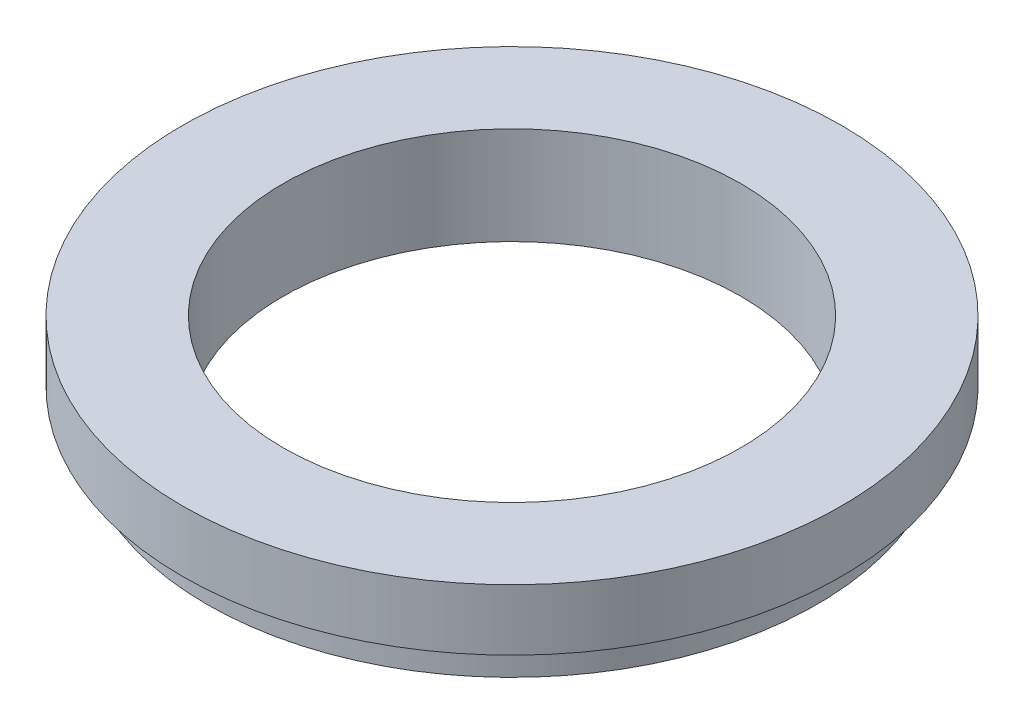
ISO-10303-21;
HEADER;
FILE_DESCRIPTION(('STEP AP214'),'2;1');
FILE_NAME('part.step','',(''),(''),'','','');
FILE_SCHEMA(('AUTOMOTIVE_DESIGN { 1 0 10303 214 1 1 1 1 }'));
ENDSEC;
DATA;
#1=APPLICATION_CONTEXT('core data for automotive mechanical design processes');
#2=APPLICATION_PROTOCOL_DEFINITION('international standard','automotive_design',2000,#1);
#3=PRODUCT_CONTEXT('',#1,'mechanical');
#4=PRODUCT('Part','Part','',(#3));
#5=PRODUCT_RELATED_PRODUCT_CATEGORY('part','',(#4));
#6=PRODUCT_DEFINITION_FORMATION('','',#4);
#7=PRODUCT_DEFINITION_CONTEXT('part definition',#1,'design');
#8=PRODUCT_DEFINITION('design','',#6,#7);
#9=PRODUCT_DEFINITION_SHAPE('','',#8);
#10=(LENGTH_UNIT() NAMED_UNIT(*) SI_UNIT(.MILLI.,.METRE.));
#11=(NAMED_UNIT(*) PLANE_ANGLE_UNIT() SI_UNIT($,.RADIAN.));
#12=(NAMED_UNIT(*) SI_UNIT($,.STERADIAN.) SOLID_ANGLE_UNIT());
#13=UNCERTAINTY_MEASURE_WITH_UNIT(LENGTH_MEASURE(1.E-05),#10,'distance_accuracy_value','');
#14=(GEOMETRIC_REPRESENTATION_CONTEXT(3) GLOBAL_UNCERTAINTY_ASSIGNED_CONTEXT((#13)) GLOBAL_UNIT_ASSIGNED_CONTEXT((#10,
#11,#12)) REPRESENTATION_CONTEXT('',''));
#15=CARTESIAN_POINT('',(0.,0.,0.));
#16=DIRECTION('',(0.,0.,1.));
#17=DIRECTION('',(1.,0.,0.));
#18=AXIS2_PLACEMENT_3D('',#15,#16,#17);
#19=CARTESIAN_POINT('',(4.7625,0.,0.));
#20=DIRECTION('',(0.,-1.,0.));
#21=DIRECTION('',(0.,0.,-1.));
#22=AXIS2_PLACEMENT_3D('',#19,#20,#21);
#23=PLANE('',#22);
#24=CARTESIAN_POINT('',(0.,0.,0.));
#25=DIRECTION('',(0.,-1.,0.));
#26=DIRECTION('',(0.,0.,-1.));
#27=AXIS2_PLACEMENT_3D('',#24,#25,#26);
#28=CIRCLE('',#27,6.34619);
#29=CARTESIAN_POINT('',(0.,0.,-6.34619));
#30=VERTEX_POINT('',#29);
#31=EDGE_CURVE('E10',#30,#30,#28,.T.);
#32=ORIENTED_EDGE('',*,*,#31,.T.);
#33=EDGE_LOOP('',(#32));
#34=FACE_BOUND('',#33,.T.);
#35=CARTESIAN_POINT('',(0.,0.,0.));
#36=DIRECTION('',(0.,-1.,0.));
#37=DIRECTION('',(0.,0.,-1.));
#38=AXIS2_PLACEMENT_3D('',#35,#36,#37);
#39=CIRCLE('',#38,4.7625);
#40=CARTESIAN_POINT('',(0.,0.,-4.7625));
#41=VERTEX_POINT('',#40);
#42=EDGE_CURVE('E53',#41,#41,#39,.T.);
#43=ORIENTED_EDGE('',*,*,#42,.F.);
#44=EDGE_LOOP('',(#43));
#45=FACE_BOUND('',#44,.T.);
#46=ADVANCED_FACE('F31',(#34,#45),#23,.T.);
#47=CARTESIAN_POINT('',(0.,2.032,0.));
#48=DIRECTION('',(0.,-1.,0.));
#49=DIRECTION('',(0.,0.,-1.));
#50=AXIS2_PLACEMENT_3D('',#47,#48,#49);
#51=CYLINDRICAL_SURFACE('',#50,6.34619);
#52=CARTESIAN_POINT('',(0.,0.762,0.));
#53=DIRECTION('',(0.,-1.,0.));
#54=DIRECTION('',(0.,0.,-1.));
#55=AXIS2_PLACEMENT_3D('',#52,#53,#54);
#56=CIRCLE('',#55,6.34619);
#57=CARTESIAN_POINT('',(0.,0.762,-6.34619));
#58=VERTEX_POINT('',#57);
#59=EDGE_CURVE('E37',#58,#58,#56,.T.);
#60=ORIENTED_EDGE('',*,*,#59,.T.);
#61=EDGE_LOOP('',(#60));
#62=FACE_BOUND('',#61,.T.);
#63=ORIENTED_EDGE('',*,*,#31,.F.);
#64=EDGE_LOOP('',(#63));
#65=FACE_BOUND('',#64,.T.);
#66=ADVANCED_FACE('F61',(#62,#65),#51,.T.);
#67=CARTESIAN_POINT('',(6.34619,0.762,0.));
#68=DIRECTION('',(0.,-1.,0.));
#69=DIRECTION('',(0.,0.,-1.));
#70=AXIS2_PLACEMENT_3D('',#67,#68,#69);
#71=PLANE('',#70);
#72=CARTESIAN_POINT('',(0.,0.762,0.));
#73=DIRECTION('',(0.,-1.,0.));
#74=DIRECTION('',(0.,0.,-1.));
#75=AXIS2_PLACEMENT_3D('',#72,#73,#74);
#76=CIRCLE('',#75,6.858);
#77=CARTESIAN_POINT('',(0.,0.762,-6.858));
#78=VERTEX_POINT('',#77);
#79=EDGE_CURVE('E41',#78,#78,#76,.T.);
#80=ORIENTED_EDGE('',*,*,#79,.T.);
#81=EDGE_LOOP('',(#80));
#82=FACE_BOUND('',#81,.T.);
#83=ORIENTED_EDGE('',*,*,#59,.F.);
#84=EDGE_LOOP('',(#83));
#85=FACE_BOUND('',#84,.T.);
#86=ADVANCED_FACE('F65',(#82,#85),#71,.T.);
#87=CARTESIAN_POINT('',(0.,2.032,0.));
#88=DIRECTION('',(0.,-1.,0.));
#89=DIRECTION('',(0.,0.,-1.));
#90=AXIS2_PLACEMENT_3D('',#87,#88,#89);
#91=CYLINDRICAL_SURFACE('',#90,6.858);
#92=CARTESIAN_POINT('',(0.,2.032,0.));
#93=DIRECTION('',(0.,-1.,0.));
#94=DIRECTION('',(0.,0.,-1.));
#95=AXIS2_PLACEMENT_3D('',#92,#93,#94);
#96=CIRCLE('',#95,6.858);
#97=CARTESIAN_POINT('',(0.,2.032,-6.858));
#98=VERTEX_POINT('',#97);
#99=EDGE_CURVE('E45',#98,#98,#96,.T.);
#100=ORIENTED_EDGE('',*,*,#99,.T.);
#101=EDGE_LOOP('',(#100));
#102=FACE_BOUND('',#101,.T.);
#103=ORIENTED_EDGE('',*,*,#79,.F.);
#104=EDGE_LOOP('',(#103));
#105=FACE_BOUND('',#104,.T.);
#106=ADVANCED_FACE('F69',(#102,#105),#91,.T.);
#107=CARTESIAN_POINT('',(6.858,2.032,0.));
#108=DIRECTION('',(0.,1.,0.));
#109=DIRECTION('',(0.,0.,1.));
#110=AXIS2_PLACEMENT_3D('',#107,#108,#109);
#111=PLANE('',#110);
#112=CARTESIAN_POINT('',(0.,2.032,0.));
#113=DIRECTION('',(0.,-1.,0.));
#114=DIRECTION('',(0.,0.,-1.));
#115=AXIS2_PLACEMENT_3D('',#112,#113,#114);
#116=CIRCLE('',#115,4.7625);
#117=CARTESIAN_POINT('',(0.,2.032,-4.7625));
#118=VERTEX_POINT('',#117);
#119=EDGE_CURVE('E50',#118,#118,#116,.T.);
#120=ORIENTED_EDGE('',*,*,#119,.T.);
#121=EDGE_LOOP('',(#120));
#122=FACE_BOUND('',#121,.T.);
#123=ORIENTED_EDGE('',*,*,#99,.F.);
#124=EDGE_LOOP('',(#123));
#125=FACE_BOUND('',#124,.T.);
#126=ADVANCED_FACE('F76',(#122,#125),#111,.T.);
#127=CARTESIAN_POINT('',(0.,2.032,0.));
#128=DIRECTION('',(0.,-1.,0.));
#129=DIRECTION('',(0.,0.,-1.));
#130=AXIS2_PLACEMENT_3D('',#127,#128,#129);
#131=CYLINDRICAL_SURFACE('',#130,4.7625);
#132=ORIENTED_EDGE('',*,*,#42,.T.);
#133=EDGE_LOOP('',(#132));
#134=FACE_BOUND('',#133,.T.);
#135=ORIENTED_EDGE('',*,*,#119,.F.);
#136=EDGE_LOOP('',(#135));
#137=FACE_BOUND('',#136,.T.);
#138=ADVANCED_FACE('F57',(#134,#137),#131,.F.);
#139=CLOSED_SHELL('',(#46,#66,#86,#106,#126,#138));
#140=MANIFOLD_SOLID_BREP('B2',#139);
#141=ADVANCED_BREP_SHAPE_REPRESENTATION('',(#18,#140),#14);
#142=SHAPE_DEFINITION_REPRESENTATION(#9,#141);
ENDSEC;
END-ISO-10303-21;
